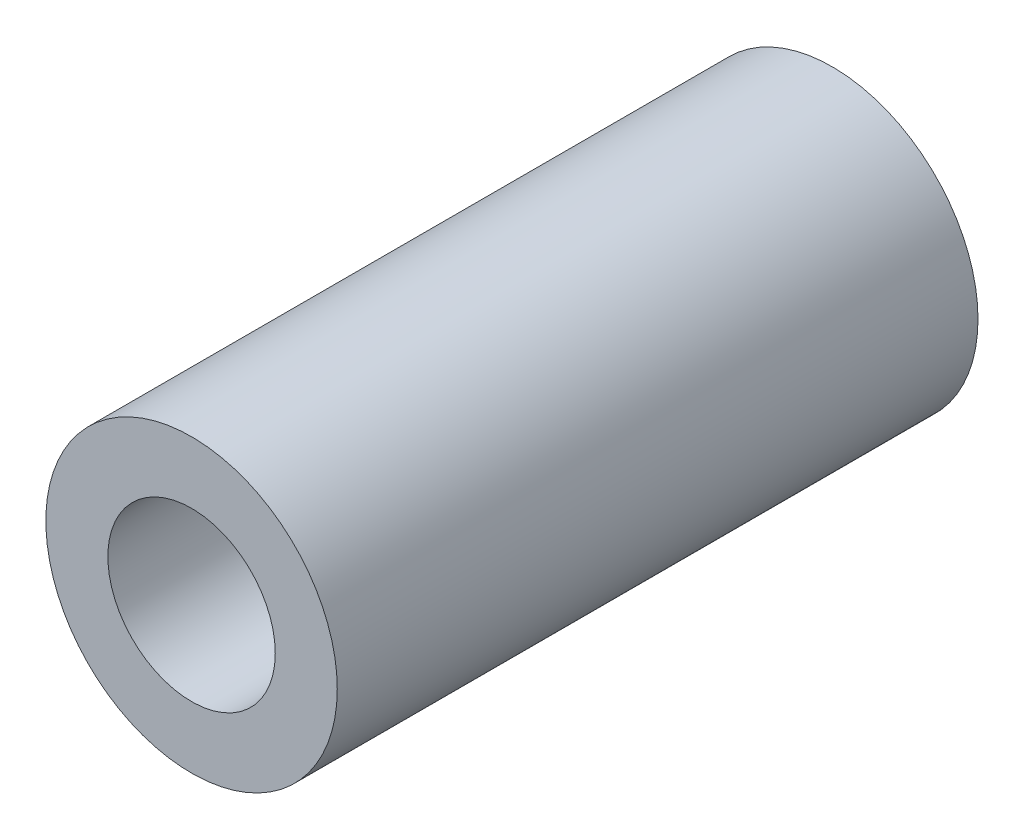
ISO-10303-21;
HEADER;
FILE_DESCRIPTION(('STEP AP214'),'2;1');
FILE_NAME('part.step','',(''),(''),'','','');
FILE_SCHEMA(('AUTOMOTIVE_DESIGN { 1 0 10303 214 1 1 1 1 }'));
ENDSEC;
DATA;
#1=APPLICATION_CONTEXT('core data for automotive mechanical design processes');
#2=APPLICATION_PROTOCOL_DEFINITION('international standard','automotive_design',2000,#1);
#3=PRODUCT_CONTEXT('',#1,'mechanical');
#4=PRODUCT('Part','Part','',(#3));
#5=PRODUCT_RELATED_PRODUCT_CATEGORY('part','',(#4));
#6=PRODUCT_DEFINITION_FORMATION('','',#4);
#7=PRODUCT_DEFINITION_CONTEXT('part definition',#1,'design');
#8=PRODUCT_DEFINITION('design','',#6,#7);
#9=PRODUCT_DEFINITION_SHAPE('','',#8);
#10=(LENGTH_UNIT() NAMED_UNIT(*) SI_UNIT(.MILLI.,.METRE.));
#11=(NAMED_UNIT(*) PLANE_ANGLE_UNIT() SI_UNIT($,.RADIAN.));
#12=(NAMED_UNIT(*) SI_UNIT($,.STERADIAN.) SOLID_ANGLE_UNIT());
#13=UNCERTAINTY_MEASURE_WITH_UNIT(LENGTH_MEASURE(1.E-05),#10,'distance_accuracy_value','');
#14=(GEOMETRIC_REPRESENTATION_CONTEXT(3) GLOBAL_UNCERTAINTY_ASSIGNED_CONTEXT((#13)) GLOBAL_UNIT_ASSIGNED_CONTEXT((#10,
#11,#12)) REPRESENTATION_CONTEXT('',''));
#15=CARTESIAN_POINT('',(0.,0.,0.));
#16=DIRECTION('',(0.,0.,1.));
#17=DIRECTION('',(1.,0.,0.));
#18=AXIS2_PLACEMENT_3D('',#15,#16,#17);
#19=CARTESIAN_POINT('',(0.,0.,31.));
#20=DIRECTION('',(0.,0.,1.));
#21=DIRECTION('',(1.,0.,0.));
#22=AXIS2_PLACEMENT_3D('',#19,#20,#21);
#23=PLANE('',#22);
#24=CARTESIAN_POINT('',(0.,0.,31.));
#25=DIRECTION('',(0.,0.,1.));
#26=DIRECTION('',(1.,0.,0.));
#27=AXIS2_PLACEMENT_3D('',#24,#25,#26);
#28=CIRCLE('',#27,7.05);
#29=CARTESIAN_POINT('',(7.05,0.,31.));
#30=VERTEX_POINT('',#29);
#31=EDGE_CURVE('E10',#30,#30,#28,.T.);
#32=ORIENTED_EDGE('',*,*,#31,.T.);
#33=EDGE_LOOP('',(#32));
#34=FACE_BOUND('',#33,.T.);
#35=CARTESIAN_POINT('',(0.,0.,31.));
#36=DIRECTION('',(0.,0.,1.));
#37=DIRECTION('',(1.,0.,0.));
#38=AXIS2_PLACEMENT_3D('',#35,#36,#37);
#39=CIRCLE('',#38,4.05);
#40=CARTESIAN_POINT('',(4.05,0.,31.));
#41=VERTEX_POINT('',#40);
#42=EDGE_CURVE('E50',#41,#41,#39,.T.);
#43=ORIENTED_EDGE('',*,*,#42,.F.);
#44=EDGE_LOOP('',(#43));
#45=FACE_BOUND('',#44,.T.);
#46=ADVANCED_FACE('F39',(#34,#45),#23,.T.);
#47=CARTESIAN_POINT('',(0.,0.,0.));
#48=DIRECTION('',(0.,0.,1.));
#49=DIRECTION('',(1.,0.,0.));
#50=AXIS2_PLACEMENT_3D('',#47,#48,#49);
#51=PLANE('',#50);
#52=CARTESIAN_POINT('',(0.,0.,0.));
#53=DIRECTION('',(0.,0.,1.));
#54=DIRECTION('',(1.,0.,0.));
#55=AXIS2_PLACEMENT_3D('',#52,#53,#54);
#56=CIRCLE('',#55,7.05);
#57=CARTESIAN_POINT('',(7.05,0.,0.));
#58=VERTEX_POINT('',#57);
#59=EDGE_CURVE('E43',#58,#58,#56,.T.);
#60=ORIENTED_EDGE('',*,*,#59,.F.);
#61=EDGE_LOOP('',(#60));
#62=FACE_BOUND('',#61,.T.);
#63=CARTESIAN_POINT('',(0.,0.,0.));
#64=DIRECTION('',(0.,0.,1.));
#65=DIRECTION('',(1.,0.,0.));
#66=AXIS2_PLACEMENT_3D('',#63,#64,#65);
#67=CIRCLE('',#66,4.05);
#68=CARTESIAN_POINT('',(4.05,0.,0.));
#69=VERTEX_POINT('',#68);
#70=EDGE_CURVE('E52',#69,#69,#67,.T.);
#71=ORIENTED_EDGE('',*,*,#70,.T.);
#72=EDGE_LOOP('',(#71));
#73=FACE_BOUND('',#72,.T.);
#74=ADVANCED_FACE('F62',(#62,#73),#51,.F.);
#75=CARTESIAN_POINT('',(0.,0.,31.));
#76=DIRECTION('',(0.,0.,-1.));
#77=DIRECTION('',(-1.,0.,0.));
#78=AXIS2_PLACEMENT_3D('',#75,#76,#77);
#79=CYLINDRICAL_SURFACE('',#78,7.05);
#80=ORIENTED_EDGE('',*,*,#31,.F.);
#81=EDGE_LOOP('',(#80));
#82=FACE_BOUND('',#81,.T.);
#83=ORIENTED_EDGE('',*,*,#59,.T.);
#84=EDGE_LOOP('',(#83));
#85=FACE_BOUND('',#84,.T.);
#86=ADVANCED_FACE('F41',(#82,#85),#79,.T.);
#87=CARTESIAN_POINT('',(0.,0.,31.));
#88=DIRECTION('',(0.,0.,-1.));
#89=DIRECTION('',(-1.,0.,0.));
#90=AXIS2_PLACEMENT_3D('',#87,#88,#89);
#91=CYLINDRICAL_SURFACE('',#90,4.05);
#92=ORIENTED_EDGE('',*,*,#42,.T.);
#93=EDGE_LOOP('',(#92));
#94=FACE_BOUND('',#93,.T.);
#95=ORIENTED_EDGE('',*,*,#70,.F.);
#96=EDGE_LOOP('',(#95));
#97=FACE_BOUND('',#96,.T.);
#98=ADVANCED_FACE('F58',(#94,#97),#91,.F.);
#99=CLOSED_SHELL('',(#46,#74,#86,#98));
#100=MANIFOLD_SOLID_BREP('B2',#99);
#101=ADVANCED_BREP_SHAPE_REPRESENTATION('',(#18,#100),#14);
#102=SHAPE_DEFINITION_REPRESENTATION(#9,#101);
ENDSEC;
END-ISO-10303-21;
